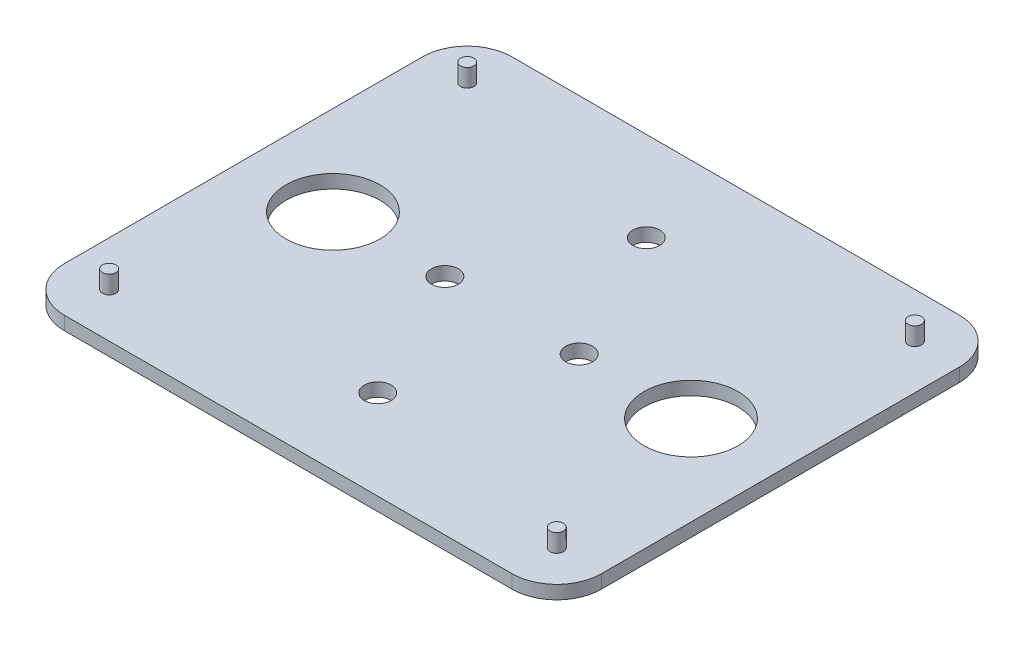
ISO-10303-21;
HEADER;
FILE_DESCRIPTION(('STEP AP214'),'2;1');
FILE_NAME('part.step','',(''),(''),'','','');
FILE_SCHEMA(('AUTOMOTIVE_DESIGN { 1 0 10303 214 1 1 1 1 }'));
ENDSEC;
DATA;
#1=APPLICATION_CONTEXT('core data for automotive mechanical design processes');
#2=APPLICATION_PROTOCOL_DEFINITION('international standard','automotive_design',2000,#1);
#3=PRODUCT_CONTEXT('',#1,'mechanical');
#4=PRODUCT('Part','Part','',(#3));
#5=PRODUCT_RELATED_PRODUCT_CATEGORY('part','',(#4));
#6=PRODUCT_DEFINITION_FORMATION('','',#4);
#7=PRODUCT_DEFINITION_CONTEXT('part definition',#1,'design');
#8=PRODUCT_DEFINITION('design','',#6,#7);
#9=PRODUCT_DEFINITION_SHAPE('','',#8);
#10=(LENGTH_UNIT() NAMED_UNIT(*) SI_UNIT(.MILLI.,.METRE.));
#11=(NAMED_UNIT(*) PLANE_ANGLE_UNIT() SI_UNIT($,.RADIAN.));
#12=(NAMED_UNIT(*) SI_UNIT($,.STERADIAN.) SOLID_ANGLE_UNIT());
#13=UNCERTAINTY_MEASURE_WITH_UNIT(LENGTH_MEASURE(1.E-05),#10,'distance_accuracy_value','');
#14=(GEOMETRIC_REPRESENTATION_CONTEXT(3) GLOBAL_UNCERTAINTY_ASSIGNED_CONTEXT((#13)) GLOBAL_UNIT_ASSIGNED_CONTEXT((#10,
#11,#12)) REPRESENTATION_CONTEXT('',''));
#15=CARTESIAN_POINT('',(0.,0.,0.));
#16=DIRECTION('',(0.,0.,1.));
#17=DIRECTION('',(1.,0.,0.));
#18=AXIS2_PLACEMENT_3D('',#15,#16,#17);
#19=CARTESIAN_POINT('',(0.,3.,0.));
#20=DIRECTION('',(-1.,0.,0.));
#21=DIRECTION('',(0.,0.,1.));
#22=AXIS2_PLACEMENT_3D('',#19,#20,#21);
#23=PLANE('',#22);
#24=DIRECTION('',(0.,0.,-1.));
#25=VECTOR('',#24,1.);
#26=CARTESIAN_POINT('',(0.,0.,0.));
#27=LINE('',#26,#25);
#28=CARTESIAN_POINT('',(0.,0.,-10.));
#29=VERTEX_POINT('',#28);
#30=CARTESIAN_POINT('',(0.,0.,-90.));
#31=VERTEX_POINT('',#30);
#32=EDGE_CURVE('E156',#29,#31,#27,.T.);
#33=ORIENTED_EDGE('',*,*,#32,.T.);
#34=DIRECTION('',(0.,-1.,0.));
#35=VECTOR('',#34,1.);
#36=CARTESIAN_POINT('',(0.,3.,-90.));
#37=LINE('',#36,#35);
#38=CARTESIAN_POINT('',(0.,3.,-90.));
#39=VERTEX_POINT('',#38);
#40=EDGE_CURVE('E11',#31,#39,#37,.F.);
#41=ORIENTED_EDGE('',*,*,#40,.T.);
#42=DIRECTION('',(0.,0.,-1.));
#43=VECTOR('',#42,1.);
#44=CARTESIAN_POINT('',(0.,3.,0.));
#45=LINE('',#44,#43);
#46=CARTESIAN_POINT('',(0.,3.,-10.));
#47=VERTEX_POINT('',#46);
#48=EDGE_CURVE('E125',#47,#39,#45,.T.);
#49=ORIENTED_EDGE('',*,*,#48,.F.);
#50=DIRECTION('',(0.,-1.,0.));
#51=VECTOR('',#50,1.);
#52=CARTESIAN_POINT('',(0.,3.,-10.));
#53=LINE('',#52,#51);
#54=EDGE_CURVE('E40',#47,#29,#53,.T.);
#55=ORIENTED_EDGE('',*,*,#54,.T.);
#56=EDGE_LOOP('',(#33,#41,#49,#55));
#57=FACE_BOUND('',#56,.T.);
#58=ADVANCED_FACE('F32',(#57),#23,.F.);
#59=CARTESIAN_POINT('',(0.,3.,-100.));
#60=DIRECTION('',(0.,0.,1.));
#61=DIRECTION('',(1.,0.,0.));
#62=AXIS2_PLACEMENT_3D('',#59,#60,#61);
#63=PLANE('',#62);
#64=DIRECTION('',(-1.,0.,0.));
#65=VECTOR('',#64,1.);
#66=CARTESIAN_POINT('',(0.,3.,-100.));
#67=LINE('',#66,#65);
#68=CARTESIAN_POINT('',(-10.,3.,-100.));
#69=VERTEX_POINT('',#68);
#70=CARTESIAN_POINT('',(-110.,3.,-100.));
#71=VERTEX_POINT('',#70);
#72=EDGE_CURVE('E128',#69,#71,#67,.T.);
#73=ORIENTED_EDGE('',*,*,#72,.F.);
#74=DIRECTION('',(0.,-1.,0.));
#75=VECTOR('',#74,1.);
#76=CARTESIAN_POINT('',(-10.,3.,-100.));
#77=LINE('',#76,#75);
#78=CARTESIAN_POINT('',(-10.,0.,-100.));
#79=VERTEX_POINT('',#78);
#80=EDGE_CURVE('E149',#69,#79,#77,.T.);
#81=ORIENTED_EDGE('',*,*,#80,.T.);
#82=DIRECTION('',(-1.,0.,0.));
#83=VECTOR('',#82,1.);
#84=CARTESIAN_POINT('',(0.,0.,-100.));
#85=LINE('',#84,#83);
#86=CARTESIAN_POINT('',(-110.,0.,-100.));
#87=VERTEX_POINT('',#86);
#88=EDGE_CURVE('E130',#79,#87,#85,.T.);
#89=ORIENTED_EDGE('',*,*,#88,.T.);
#90=DIRECTION('',(0.,-1.,0.));
#91=VECTOR('',#90,1.);
#92=CARTESIAN_POINT('',(-110.,3.,-100.));
#93=LINE('',#92,#91);
#94=EDGE_CURVE('E47',#87,#71,#93,.F.);
#95=ORIENTED_EDGE('',*,*,#94,.T.);
#96=EDGE_LOOP('',(#73,#81,#89,#95));
#97=FACE_BOUND('',#96,.T.);
#98=ADVANCED_FACE('F265',(#97),#63,.F.);
#99=CARTESIAN_POINT('',(-120.,3.,0.));
#100=DIRECTION('',(1.,0.,0.));
#101=DIRECTION('',(0.,0.,-1.));
#102=AXIS2_PLACEMENT_3D('',#99,#100,#101);
#103=PLANE('',#102);
#104=DIRECTION('',(0.,0.,1.));
#105=VECTOR('',#104,1.);
#106=CARTESIAN_POINT('',(-120.,0.,0.));
#107=LINE('',#106,#105);
#108=CARTESIAN_POINT('',(-120.,0.,-90.));
#109=VERTEX_POINT('',#108);
#110=CARTESIAN_POINT('',(-120.,0.,-9.99999999999998));
#111=VERTEX_POINT('',#110);
#112=EDGE_CURVE('E126',#109,#111,#107,.T.);
#113=ORIENTED_EDGE('',*,*,#112,.T.);
#114=DIRECTION('',(0.,-1.,0.));
#115=VECTOR('',#114,1.);
#116=CARTESIAN_POINT('',(-120.,3.,-9.99999999999999));
#117=LINE('',#116,#115);
#118=CARTESIAN_POINT('',(-120.,3.,-9.99999999999998));
#119=VERTEX_POINT('',#118);
#120=EDGE_CURVE('E103',#111,#119,#117,.F.);
#121=ORIENTED_EDGE('',*,*,#120,.T.);
#122=DIRECTION('',(0.,0.,1.));
#123=VECTOR('',#122,1.);
#124=CARTESIAN_POINT('',(-120.,3.,0.));
#125=LINE('',#124,#123);
#126=CARTESIAN_POINT('',(-120.,3.,-90.));
#127=VERTEX_POINT('',#126);
#128=EDGE_CURVE('E168',#127,#119,#125,.T.);
#129=ORIENTED_EDGE('',*,*,#128,.F.);
#130=DIRECTION('',(0.,-1.,0.));
#131=VECTOR('',#130,1.);
#132=CARTESIAN_POINT('',(-120.,3.,-90.));
#133=LINE('',#132,#131);
#134=EDGE_CURVE('E108',#127,#109,#133,.T.);
#135=ORIENTED_EDGE('',*,*,#134,.T.);
#136=EDGE_LOOP('',(#113,#121,#129,#135));
#137=FACE_BOUND('',#136,.T.);
#138=ADVANCED_FACE('F263',(#137),#103,.F.);
#139=CARTESIAN_POINT('',(0.,3.,0.));
#140=DIRECTION('',(0.,0.,-1.));
#141=DIRECTION('',(-1.,0.,0.));
#142=AXIS2_PLACEMENT_3D('',#139,#140,#141);
#143=PLANE('',#142);
#144=DIRECTION('',(1.,0.,0.));
#145=VECTOR('',#144,1.);
#146=CARTESIAN_POINT('',(0.,3.,0.));
#147=LINE('',#146,#145);
#148=CARTESIAN_POINT('',(-110.,3.,0.));
#149=VERTEX_POINT('',#148);
#150=CARTESIAN_POINT('',(-10.,3.,0.));
#151=VERTEX_POINT('',#150);
#152=EDGE_CURVE('E118',#149,#151,#147,.T.);
#153=ORIENTED_EDGE('',*,*,#152,.F.);
#154=DIRECTION('',(0.,-1.,0.));
#155=VECTOR('',#154,1.);
#156=CARTESIAN_POINT('',(-110.,3.,0.));
#157=LINE('',#156,#155);
#158=CARTESIAN_POINT('',(-110.,0.,0.));
#159=VERTEX_POINT('',#158);
#160=EDGE_CURVE('E102',#149,#159,#157,.T.);
#161=ORIENTED_EDGE('',*,*,#160,.T.);
#162=DIRECTION('',(1.,0.,0.));
#163=VECTOR('',#162,1.);
#164=CARTESIAN_POINT('',(0.,0.,0.));
#165=LINE('',#164,#163);
#166=CARTESIAN_POINT('',(-10.,0.,0.));
#167=VERTEX_POINT('',#166);
#168=EDGE_CURVE('E115',#159,#167,#165,.T.);
#169=ORIENTED_EDGE('',*,*,#168,.T.);
#170=DIRECTION('',(0.,-1.,0.));
#171=VECTOR('',#170,1.);
#172=CARTESIAN_POINT('',(-10.,3.,0.));
#173=LINE('',#172,#171);
#174=EDGE_CURVE('E120',#167,#151,#173,.F.);
#175=ORIENTED_EDGE('',*,*,#174,.T.);
#176=EDGE_LOOP('',(#153,#161,#169,#175));
#177=FACE_BOUND('',#176,.T.);
#178=ADVANCED_FACE('F114',(#177),#143,.F.);
#179=CARTESIAN_POINT('',(0.,3.,0.));
#180=DIRECTION('',(0.,1.,0.));
#181=DIRECTION('',(0.,0.,1.));
#182=AXIS2_PLACEMENT_3D('',#179,#180,#181);
#183=PLANE('',#182);
#184=CARTESIAN_POINT('',(-60.,3.,-20.));
#185=DIRECTION('',(0.,1.,0.));
#186=DIRECTION('',(0.,0.,1.));
#187=AXIS2_PLACEMENT_3D('',#184,#185,#186);
#188=CIRCLE('',#187,3.);
#189=CARTESIAN_POINT('',(-60.,3.,-17.));
#190=VERTEX_POINT('',#189);
#191=EDGE_CURVE('E223',#190,#190,#188,.T.);
#192=ORIENTED_EDGE('',*,*,#191,.F.);
#193=EDGE_LOOP('',(#192));
#194=FACE_BOUND('',#193,.T.);
#195=CARTESIAN_POINT('',(-60.,3.,-80.));
#196=DIRECTION('',(0.,1.,0.));
#197=DIRECTION('',(0.,0.,1.));
#198=AXIS2_PLACEMENT_3D('',#195,#196,#197);
#199=CIRCLE('',#198,3.);
#200=CARTESIAN_POINT('',(-60.,3.,-77.));
#201=VERTEX_POINT('',#200);
#202=EDGE_CURVE('E217',#201,#201,#199,.T.);
#203=ORIENTED_EDGE('',*,*,#202,.F.);
#204=EDGE_LOOP('',(#203));
#205=FACE_BOUND('',#204,.T.);
#206=CARTESIAN_POINT('',(-45.,3.,-50.));
#207=DIRECTION('',(0.,1.,0.));
#208=DIRECTION('',(0.,0.,1.));
#209=AXIS2_PLACEMENT_3D('',#206,#207,#208);
#210=CIRCLE('',#209,3.);
#211=CARTESIAN_POINT('',(-45.,3.,-47.));
#212=VERTEX_POINT('',#211);
#213=EDGE_CURVE('E211',#212,#212,#210,.T.);
#214=ORIENTED_EDGE('',*,*,#213,.F.);
#215=EDGE_LOOP('',(#214));
#216=FACE_BOUND('',#215,.T.);
#217=CARTESIAN_POINT('',(-75.,3.,-50.));
#218=DIRECTION('',(0.,1.,0.));
#219=DIRECTION('',(0.,0.,1.));
#220=AXIS2_PLACEMENT_3D('',#217,#218,#219);
#221=CIRCLE('',#220,3.00000000000001);
#222=CARTESIAN_POINT('',(-75.,3.,-47.));
#223=VERTEX_POINT('',#222);
#224=EDGE_CURVE('E205',#223,#223,#221,.T.);
#225=ORIENTED_EDGE('',*,*,#224,.F.);
#226=EDGE_LOOP('',(#225));
#227=FACE_BOUND('',#226,.T.);
#228=CARTESIAN_POINT('',(-20.,3.,-50.));
#229=DIRECTION('',(0.,1.,0.));
#230=DIRECTION('',(0.,0.,1.));
#231=AXIS2_PLACEMENT_3D('',#228,#229,#230);
#232=CIRCLE('',#231,10.5);
#233=CARTESIAN_POINT('',(-20.,3.,-39.5));
#234=VERTEX_POINT('',#233);
#235=EDGE_CURVE('E199',#234,#234,#232,.T.);
#236=ORIENTED_EDGE('',*,*,#235,.F.);
#237=EDGE_LOOP('',(#236));
#238=FACE_BOUND('',#237,.T.);
#239=CARTESIAN_POINT('',(-100.,3.,-50.));
#240=DIRECTION('',(0.,1.,0.));
#241=DIRECTION('',(0.,0.,1.));
#242=AXIS2_PLACEMENT_3D('',#239,#240,#241);
#243=CIRCLE('',#242,10.5);
#244=CARTESIAN_POINT('',(-100.,3.,-39.5));
#245=VERTEX_POINT('',#244);
#246=EDGE_CURVE('E193',#245,#245,#243,.T.);
#247=ORIENTED_EDGE('',*,*,#246,.F.);
#248=EDGE_LOOP('',(#247));
#249=FACE_BOUND('',#248,.T.);
#250=CARTESIAN_POINT('',(-110.,3.,-9.99999999999998));
#251=DIRECTION('',(0.,1.,0.));
#252=DIRECTION('',(0.,0.,1.));
#253=AXIS2_PLACEMENT_3D('',#250,#251,#252);
#254=CIRCLE('',#253,1.5);
#255=CARTESIAN_POINT('',(-110.,3.,-8.49999999999998));
#256=VERTEX_POINT('',#255);
#257=EDGE_CURVE('E187',#256,#256,#254,.T.);
#258=ORIENTED_EDGE('',*,*,#257,.F.);
#259=EDGE_LOOP('',(#258));
#260=FACE_BOUND('',#259,.T.);
#261=CARTESIAN_POINT('',(-10.,3.,-9.99999999999998));
#262=DIRECTION('',(0.,1.,0.));
#263=DIRECTION('',(0.,0.,1.));
#264=AXIS2_PLACEMENT_3D('',#261,#262,#263);
#265=CIRCLE('',#264,1.5);
#266=CARTESIAN_POINT('',(-10.,3.,-8.49999999999998));
#267=VERTEX_POINT('',#266);
#268=EDGE_CURVE('E181',#267,#267,#265,.T.);
#269=ORIENTED_EDGE('',*,*,#268,.F.);
#270=EDGE_LOOP('',(#269));
#271=FACE_BOUND('',#270,.T.);
#272=CARTESIAN_POINT('',(-10.,3.,-90.));
#273=DIRECTION('',(0.,1.,0.));
#274=DIRECTION('',(0.,0.,1.));
#275=AXIS2_PLACEMENT_3D('',#272,#273,#274);
#276=CIRCLE('',#275,1.5);
#277=CARTESIAN_POINT('',(-10.,3.,-88.5));
#278=VERTEX_POINT('',#277);
#279=EDGE_CURVE('E175',#278,#278,#276,.T.);
#280=ORIENTED_EDGE('',*,*,#279,.F.);
#281=EDGE_LOOP('',(#280));
#282=FACE_BOUND('',#281,.T.);
#283=CARTESIAN_POINT('',(-110.,3.,-90.));
#284=DIRECTION('',(0.,1.,0.));
#285=DIRECTION('',(0.,0.,1.));
#286=AXIS2_PLACEMENT_3D('',#283,#284,#285);
#287=CIRCLE('',#286,1.5);
#288=CARTESIAN_POINT('',(-110.,3.,-88.5));
#289=VERTEX_POINT('',#288);
#290=EDGE_CURVE('E164',#289,#289,#287,.T.);
#291=ORIENTED_EDGE('',*,*,#290,.F.);
#292=EDGE_LOOP('',(#291));
#293=FACE_BOUND('',#292,.T.);
#294=ORIENTED_EDGE('',*,*,#128,.T.);
#295=CARTESIAN_POINT('',(-110.,3.,-9.99999999999999));
#296=DIRECTION('',(0.,1.,0.));
#297=DIRECTION('',(0.,0.,1.));
#298=AXIS2_PLACEMENT_3D('',#295,#296,#297);
#299=CIRCLE('',#298,10.);
#300=EDGE_CURVE('E146',#119,#149,#299,.T.);
#301=ORIENTED_EDGE('',*,*,#300,.T.);
#302=ORIENTED_EDGE('',*,*,#152,.T.);
#303=CARTESIAN_POINT('',(-10.,3.,-10.));
#304=DIRECTION('',(0.,1.,0.));
#305=DIRECTION('',(0.,0.,1.));
#306=AXIS2_PLACEMENT_3D('',#303,#304,#305);
#307=CIRCLE('',#306,10.);
#308=EDGE_CURVE('E143',#151,#47,#307,.T.);
#309=ORIENTED_EDGE('',*,*,#308,.T.);
#310=ORIENTED_EDGE('',*,*,#48,.T.);
#311=CARTESIAN_POINT('',(-10.,3.,-90.));
#312=DIRECTION('',(0.,1.,0.));
#313=DIRECTION('',(0.,0.,1.));
#314=AXIS2_PLACEMENT_3D('',#311,#312,#313);
#315=CIRCLE('',#314,10.);
#316=EDGE_CURVE('E54',#39,#69,#315,.T.);
#317=ORIENTED_EDGE('',*,*,#316,.T.);
#318=ORIENTED_EDGE('',*,*,#72,.T.);
#319=CARTESIAN_POINT('',(-110.,3.,-90.));
#320=DIRECTION('',(0.,1.,0.));
#321=DIRECTION('',(0.,0.,1.));
#322=AXIS2_PLACEMENT_3D('',#319,#320,#321);
#323=CIRCLE('',#322,10.);
#324=EDGE_CURVE('E141',#71,#127,#323,.T.);
#325=ORIENTED_EDGE('',*,*,#324,.T.);
#326=EDGE_LOOP('',(#294,#301,#302,#309,#310,#317,#318,#325));
#327=FACE_BOUND('',#326,.T.);
#328=ADVANCED_FACE('F238',(#194,#205,#216,#227,#238,#249,#260,#271,#282,#293,#327),#183,.T.);
#329=CARTESIAN_POINT('',(0.,0.,0.));
#330=DIRECTION('',(0.,1.,0.));
#331=DIRECTION('',(0.,0.,1.));
#332=AXIS2_PLACEMENT_3D('',#329,#330,#331);
#333=PLANE('',#332);
#334=CARTESIAN_POINT('',(-60.,0.,-20.));
#335=DIRECTION('',(0.,1.,0.));
#336=DIRECTION('',(0.,0.,1.));
#337=AXIS2_PLACEMENT_3D('',#334,#335,#336);
#338=CIRCLE('',#337,3.);
#339=CARTESIAN_POINT('',(-60.,0.,-17.));
#340=VERTEX_POINT('',#339);
#341=EDGE_CURVE('E220',#340,#340,#338,.T.);
#342=ORIENTED_EDGE('',*,*,#341,.T.);
#343=EDGE_LOOP('',(#342));
#344=FACE_BOUND('',#343,.T.);
#345=CARTESIAN_POINT('',(-60.,0.,-80.));
#346=DIRECTION('',(0.,1.,0.));
#347=DIRECTION('',(0.,0.,1.));
#348=AXIS2_PLACEMENT_3D('',#345,#346,#347);
#349=CIRCLE('',#348,3.);
#350=CARTESIAN_POINT('',(-60.,0.,-77.));
#351=VERTEX_POINT('',#350);
#352=EDGE_CURVE('E214',#351,#351,#349,.T.);
#353=ORIENTED_EDGE('',*,*,#352,.T.);
#354=EDGE_LOOP('',(#353));
#355=FACE_BOUND('',#354,.T.);
#356=CARTESIAN_POINT('',(-45.,0.,-50.));
#357=DIRECTION('',(0.,1.,0.));
#358=DIRECTION('',(0.,0.,1.));
#359=AXIS2_PLACEMENT_3D('',#356,#357,#358);
#360=CIRCLE('',#359,3.);
#361=CARTESIAN_POINT('',(-45.,0.,-47.));
#362=VERTEX_POINT('',#361);
#363=EDGE_CURVE('E208',#362,#362,#360,.T.);
#364=ORIENTED_EDGE('',*,*,#363,.T.);
#365=EDGE_LOOP('',(#364));
#366=FACE_BOUND('',#365,.T.);
#367=CARTESIAN_POINT('',(-75.,0.,-50.));
#368=DIRECTION('',(0.,1.,0.));
#369=DIRECTION('',(0.,0.,1.));
#370=AXIS2_PLACEMENT_3D('',#367,#368,#369);
#371=CIRCLE('',#370,3.00000000000001);
#372=CARTESIAN_POINT('',(-75.,0.,-47.));
#373=VERTEX_POINT('',#372);
#374=EDGE_CURVE('E202',#373,#373,#371,.T.);
#375=ORIENTED_EDGE('',*,*,#374,.T.);
#376=EDGE_LOOP('',(#375));
#377=FACE_BOUND('',#376,.T.);
#378=CARTESIAN_POINT('',(-20.,0.,-50.));
#379=DIRECTION('',(0.,1.,0.));
#380=DIRECTION('',(0.,0.,1.));
#381=AXIS2_PLACEMENT_3D('',#378,#379,#380);
#382=CIRCLE('',#381,10.5);
#383=CARTESIAN_POINT('',(-20.,0.,-39.5));
#384=VERTEX_POINT('',#383);
#385=EDGE_CURVE('E196',#384,#384,#382,.T.);
#386=ORIENTED_EDGE('',*,*,#385,.T.);
#387=EDGE_LOOP('',(#386));
#388=FACE_BOUND('',#387,.T.);
#389=CARTESIAN_POINT('',(-100.,0.,-50.));
#390=DIRECTION('',(0.,1.,0.));
#391=DIRECTION('',(0.,0.,1.));
#392=AXIS2_PLACEMENT_3D('',#389,#390,#391);
#393=CIRCLE('',#392,10.5);
#394=CARTESIAN_POINT('',(-100.,0.,-39.5));
#395=VERTEX_POINT('',#394);
#396=EDGE_CURVE('E190',#395,#395,#393,.T.);
#397=ORIENTED_EDGE('',*,*,#396,.T.);
#398=EDGE_LOOP('',(#397));
#399=FACE_BOUND('',#398,.T.);
#400=ORIENTED_EDGE('',*,*,#168,.F.);
#401=CARTESIAN_POINT('',(-110.,0.,-9.99999999999999));
#402=DIRECTION('',(0.,1.,0.));
#403=DIRECTION('',(0.,0.,1.));
#404=AXIS2_PLACEMENT_3D('',#401,#402,#403);
#405=CIRCLE('',#404,10.);
#406=EDGE_CURVE('E98',#159,#111,#405,.F.);
#407=ORIENTED_EDGE('',*,*,#406,.T.);
#408=ORIENTED_EDGE('',*,*,#112,.F.);
#409=CARTESIAN_POINT('',(-110.,0.,-90.));
#410=DIRECTION('',(0.,1.,0.));
#411=DIRECTION('',(0.,0.,1.));
#412=AXIS2_PLACEMENT_3D('',#409,#410,#411);
#413=CIRCLE('',#412,10.);
#414=EDGE_CURVE('E119',#109,#87,#413,.F.);
#415=ORIENTED_EDGE('',*,*,#414,.T.);
#416=ORIENTED_EDGE('',*,*,#88,.F.);
#417=CARTESIAN_POINT('',(-10.,0.,-90.));
#418=DIRECTION('',(0.,1.,0.));
#419=DIRECTION('',(0.,0.,1.));
#420=AXIS2_PLACEMENT_3D('',#417,#418,#419);
#421=CIRCLE('',#420,10.);
#422=EDGE_CURVE('E109',#79,#31,#421,.F.);
#423=ORIENTED_EDGE('',*,*,#422,.T.);
#424=ORIENTED_EDGE('',*,*,#32,.F.);
#425=CARTESIAN_POINT('',(-10.,0.,-10.));
#426=DIRECTION('',(0.,1.,0.));
#427=DIRECTION('',(0.,0.,1.));
#428=AXIS2_PLACEMENT_3D('',#425,#426,#427);
#429=CIRCLE('',#428,10.);
#430=EDGE_CURVE('E124',#29,#167,#429,.F.);
#431=ORIENTED_EDGE('',*,*,#430,.T.);
#432=EDGE_LOOP('',(#400,#407,#408,#415,#416,#423,#424,#431));
#433=FACE_BOUND('',#432,.T.);
#434=ADVANCED_FACE('F122',(#344,#355,#366,#377,#388,#399,#433),#333,.F.);
#435=CARTESIAN_POINT('',(-110.,3.,-9.99999999999999));
#436=DIRECTION('',(0.,-1.,0.));
#437=DIRECTION('',(0.,0.,-1.));
#438=AXIS2_PLACEMENT_3D('',#435,#436,#437);
#439=CYLINDRICAL_SURFACE('',#438,10.);
#440=ORIENTED_EDGE('',*,*,#300,.F.);
#441=ORIENTED_EDGE('',*,*,#120,.F.);
#442=ORIENTED_EDGE('',*,*,#406,.F.);
#443=ORIENTED_EDGE('',*,*,#160,.F.);
#444=EDGE_LOOP('',(#440,#441,#442,#443));
#445=FACE_BOUND('',#444,.T.);
#446=ADVANCED_FACE('F101',(#445),#439,.T.);
#447=CARTESIAN_POINT('',(-10.,3.,-90.));
#448=DIRECTION('',(0.,-1.,0.));
#449=DIRECTION('',(0.,0.,-1.));
#450=AXIS2_PLACEMENT_3D('',#447,#448,#449);
#451=CYLINDRICAL_SURFACE('',#450,10.);
#452=ORIENTED_EDGE('',*,*,#316,.F.);
#453=ORIENTED_EDGE('',*,*,#40,.F.);
#454=ORIENTED_EDGE('',*,*,#422,.F.);
#455=ORIENTED_EDGE('',*,*,#80,.F.);
#456=EDGE_LOOP('',(#452,#453,#454,#455));
#457=FACE_BOUND('',#456,.T.);
#458=ADVANCED_FACE('F268',(#457),#451,.T.);
#459=CARTESIAN_POINT('',(-10.,3.,-10.));
#460=DIRECTION('',(0.,-1.,0.));
#461=DIRECTION('',(0.,0.,-1.));
#462=AXIS2_PLACEMENT_3D('',#459,#460,#461);
#463=CYLINDRICAL_SURFACE('',#462,10.);
#464=ORIENTED_EDGE('',*,*,#308,.F.);
#465=ORIENTED_EDGE('',*,*,#174,.F.);
#466=ORIENTED_EDGE('',*,*,#430,.F.);
#467=ORIENTED_EDGE('',*,*,#54,.F.);
#468=EDGE_LOOP('',(#464,#465,#466,#467));
#469=FACE_BOUND('',#468,.T.);
#470=ADVANCED_FACE('F269',(#469),#463,.T.);
#471=CARTESIAN_POINT('',(-110.,3.,-90.));
#472=DIRECTION('',(0.,-1.,0.));
#473=DIRECTION('',(0.,0.,-1.));
#474=AXIS2_PLACEMENT_3D('',#471,#472,#473);
#475=CYLINDRICAL_SURFACE('',#474,10.);
#476=ORIENTED_EDGE('',*,*,#324,.F.);
#477=ORIENTED_EDGE('',*,*,#94,.F.);
#478=ORIENTED_EDGE('',*,*,#414,.F.);
#479=ORIENTED_EDGE('',*,*,#134,.F.);
#480=EDGE_LOOP('',(#476,#477,#478,#479));
#481=FACE_BOUND('',#480,.T.);
#482=ADVANCED_FACE('F34',(#481),#475,.T.);
#483=CARTESIAN_POINT('',(-110.,7.,-90.));
#484=DIRECTION('',(0.,-1.,0.));
#485=DIRECTION('',(0.,0.,-1.));
#486=AXIS2_PLACEMENT_3D('',#483,#484,#485);
#487=CYLINDRICAL_SURFACE('',#486,1.5);
#488=CARTESIAN_POINT('',(-110.,7.,-90.));
#489=DIRECTION('',(0.,1.,0.));
#490=DIRECTION('',(0.,0.,1.));
#491=AXIS2_PLACEMENT_3D('',#488,#489,#490);
#492=CIRCLE('',#491,1.5);
#493=CARTESIAN_POINT('',(-110.,7.,-88.5));
#494=VERTEX_POINT('',#493);
#495=EDGE_CURVE('E161',#494,#494,#492,.T.);
#496=ORIENTED_EDGE('',*,*,#495,.F.);
#497=EDGE_LOOP('',(#496));
#498=FACE_BOUND('',#497,.T.);
#499=ORIENTED_EDGE('',*,*,#290,.T.);
#500=EDGE_LOOP('',(#499));
#501=FACE_BOUND('',#500,.T.);
#502=ADVANCED_FACE('F275',(#498,#501),#487,.T.);
#503=CARTESIAN_POINT('',(-110.,7.,-90.));
#504=DIRECTION('',(0.,1.,0.));
#505=DIRECTION('',(0.,0.,1.));
#506=AXIS2_PLACEMENT_3D('',#503,#504,#505);
#507=PLANE('',#506);
#508=ORIENTED_EDGE('',*,*,#495,.T.);
#509=EDGE_LOOP('',(#508));
#510=FACE_BOUND('',#509,.T.);
#511=ADVANCED_FACE('F402',(#510),#507,.T.);
#512=CARTESIAN_POINT('',(-10.,7.,-90.));
#513=DIRECTION('',(0.,-1.,0.));
#514=DIRECTION('',(0.,0.,-1.));
#515=AXIS2_PLACEMENT_3D('',#512,#513,#514);
#516=CYLINDRICAL_SURFACE('',#515,1.5);
#517=CARTESIAN_POINT('',(-10.,7.,-90.));
#518=DIRECTION('',(0.,1.,0.));
#519=DIRECTION('',(0.,0.,1.));
#520=AXIS2_PLACEMENT_3D('',#517,#518,#519);
#521=CIRCLE('',#520,1.5);
#522=CARTESIAN_POINT('',(-10.,7.,-88.5));
#523=VERTEX_POINT('',#522);
#524=EDGE_CURVE('E173',#523,#523,#521,.T.);
#525=ORIENTED_EDGE('',*,*,#524,.F.);
#526=EDGE_LOOP('',(#525));
#527=FACE_BOUND('',#526,.T.);
#528=ORIENTED_EDGE('',*,*,#279,.T.);
#529=EDGE_LOOP('',(#528));
#530=FACE_BOUND('',#529,.T.);
#531=ADVANCED_FACE('F398',(#527,#530),#516,.T.);
#532=CARTESIAN_POINT('',(-10.,7.,-90.));
#533=DIRECTION('',(0.,1.,0.));
#534=DIRECTION('',(0.,0.,1.));
#535=AXIS2_PLACEMENT_3D('',#532,#533,#534);
#536=PLANE('',#535);
#537=ORIENTED_EDGE('',*,*,#524,.T.);
#538=EDGE_LOOP('',(#537));
#539=FACE_BOUND('',#538,.T.);
#540=ADVANCED_FACE('F394',(#539),#536,.T.);
#541=CARTESIAN_POINT('',(-10.,7.,-9.99999999999998));
#542=DIRECTION('',(0.,-1.,0.));
#543=DIRECTION('',(0.,0.,-1.));
#544=AXIS2_PLACEMENT_3D('',#541,#542,#543);
#545=CYLINDRICAL_SURFACE('',#544,1.5);
#546=CARTESIAN_POINT('',(-10.,7.,-9.99999999999998));
#547=DIRECTION('',(0.,1.,0.));
#548=DIRECTION('',(0.,0.,1.));
#549=AXIS2_PLACEMENT_3D('',#546,#547,#548);
#550=CIRCLE('',#549,1.5);
#551=CARTESIAN_POINT('',(-10.,7.,-8.49999999999998));
#552=VERTEX_POINT('',#551);
#553=EDGE_CURVE('E178',#552,#552,#550,.T.);
#554=ORIENTED_EDGE('',*,*,#553,.F.);
#555=EDGE_LOOP('',(#554));
#556=FACE_BOUND('',#555,.T.);
#557=ORIENTED_EDGE('',*,*,#268,.T.);
#558=EDGE_LOOP('',(#557));
#559=FACE_BOUND('',#558,.T.);
#560=ADVANCED_FACE('F390',(#556,#559),#545,.T.);
#561=CARTESIAN_POINT('',(-10.,7.,-9.99999999999998));
#562=DIRECTION('',(0.,1.,0.));
#563=DIRECTION('',(0.,0.,1.));
#564=AXIS2_PLACEMENT_3D('',#561,#562,#563);
#565=PLANE('',#564);
#566=ORIENTED_EDGE('',*,*,#553,.T.);
#567=EDGE_LOOP('',(#566));
#568=FACE_BOUND('',#567,.T.);
#569=ADVANCED_FACE('F386',(#568),#565,.T.);
#570=CARTESIAN_POINT('',(-110.,7.,-9.99999999999998));
#571=DIRECTION('',(0.,-1.,0.));
#572=DIRECTION('',(0.,0.,-1.));
#573=AXIS2_PLACEMENT_3D('',#570,#571,#572);
#574=CYLINDRICAL_SURFACE('',#573,1.5);
#575=CARTESIAN_POINT('',(-110.,7.,-9.99999999999998));
#576=DIRECTION('',(0.,1.,0.));
#577=DIRECTION('',(0.,0.,1.));
#578=AXIS2_PLACEMENT_3D('',#575,#576,#577);
#579=CIRCLE('',#578,1.5);
#580=CARTESIAN_POINT('',(-110.,7.,-8.49999999999998));
#581=VERTEX_POINT('',#580);
#582=EDGE_CURVE('E184',#581,#581,#579,.T.);
#583=ORIENTED_EDGE('',*,*,#582,.F.);
#584=EDGE_LOOP('',(#583));
#585=FACE_BOUND('',#584,.T.);
#586=ORIENTED_EDGE('',*,*,#257,.T.);
#587=EDGE_LOOP('',(#586));
#588=FACE_BOUND('',#587,.T.);
#589=ADVANCED_FACE('F382',(#585,#588),#574,.T.);
#590=CARTESIAN_POINT('',(-110.,7.,-9.99999999999998));
#591=DIRECTION('',(0.,1.,0.));
#592=DIRECTION('',(0.,0.,1.));
#593=AXIS2_PLACEMENT_3D('',#590,#591,#592);
#594=PLANE('',#593);
#595=ORIENTED_EDGE('',*,*,#582,.T.);
#596=EDGE_LOOP('',(#595));
#597=FACE_BOUND('',#596,.T.);
#598=ADVANCED_FACE('F314',(#597),#594,.T.);
#599=CARTESIAN_POINT('',(-100.,0.,-50.));
#600=DIRECTION('',(0.,1.,0.));
#601=DIRECTION('',(0.,0.,1.));
#602=AXIS2_PLACEMENT_3D('',#599,#600,#601);
#603=CYLINDRICAL_SURFACE('',#602,10.5);
#604=ORIENTED_EDGE('',*,*,#396,.F.);
#605=EDGE_LOOP('',(#604));
#606=FACE_BOUND('',#605,.T.);
#607=ORIENTED_EDGE('',*,*,#246,.T.);
#608=EDGE_LOOP('',(#607));
#609=FACE_BOUND('',#608,.T.);
#610=ADVANCED_FACE('F324',(#606,#609),#603,.F.);
#611=CARTESIAN_POINT('',(-20.,0.,-50.));
#612=DIRECTION('',(0.,1.,0.));
#613=DIRECTION('',(0.,0.,1.));
#614=AXIS2_PLACEMENT_3D('',#611,#612,#613);
#615=CYLINDRICAL_SURFACE('',#614,10.5);
#616=ORIENTED_EDGE('',*,*,#385,.F.);
#617=EDGE_LOOP('',(#616));
#618=FACE_BOUND('',#617,.T.);
#619=ORIENTED_EDGE('',*,*,#235,.T.);
#620=EDGE_LOOP('',(#619));
#621=FACE_BOUND('',#620,.T.);
#622=ADVANCED_FACE('F329',(#618,#621),#615,.F.);
#623=CARTESIAN_POINT('',(-75.,0.,-50.));
#624=DIRECTION('',(0.,1.,0.));
#625=DIRECTION('',(0.,0.,1.));
#626=AXIS2_PLACEMENT_3D('',#623,#624,#625);
#627=CYLINDRICAL_SURFACE('',#626,3.00000000000001);
#628=ORIENTED_EDGE('',*,*,#374,.F.);
#629=EDGE_LOOP('',(#628));
#630=FACE_BOUND('',#629,.T.);
#631=ORIENTED_EDGE('',*,*,#224,.T.);
#632=EDGE_LOOP('',(#631));
#633=FACE_BOUND('',#632,.T.);
#634=ADVANCED_FACE('F339',(#630,#633),#627,.F.);
#635=CARTESIAN_POINT('',(-45.,0.,-50.));
#636=DIRECTION('',(0.,1.,0.));
#637=DIRECTION('',(0.,0.,1.));
#638=AXIS2_PLACEMENT_3D('',#635,#636,#637);
#639=CYLINDRICAL_SURFACE('',#638,3.);
#640=ORIENTED_EDGE('',*,*,#363,.F.);
#641=EDGE_LOOP('',(#640));
#642=FACE_BOUND('',#641,.T.);
#643=ORIENTED_EDGE('',*,*,#213,.T.);
#644=EDGE_LOOP('',(#643));
#645=FACE_BOUND('',#644,.T.);
#646=ADVANCED_FACE('F349',(#642,#645),#639,.F.);
#647=CARTESIAN_POINT('',(-60.,0.,-80.));
#648=DIRECTION('',(0.,1.,0.));
#649=DIRECTION('',(0.,0.,1.));
#650=AXIS2_PLACEMENT_3D('',#647,#648,#649);
#651=CYLINDRICAL_SURFACE('',#650,3.);
#652=ORIENTED_EDGE('',*,*,#352,.F.);
#653=EDGE_LOOP('',(#652));
#654=FACE_BOUND('',#653,.T.);
#655=ORIENTED_EDGE('',*,*,#202,.T.);
#656=EDGE_LOOP('',(#655));
#657=FACE_BOUND('',#656,.T.);
#658=ADVANCED_FACE('F234',(#654,#657),#651,.F.);
#659=CARTESIAN_POINT('',(-60.,0.,-20.));
#660=DIRECTION('',(0.,1.,0.));
#661=DIRECTION('',(0.,0.,1.));
#662=AXIS2_PLACEMENT_3D('',#659,#660,#661);
#663=CYLINDRICAL_SURFACE('',#662,3.);
#664=ORIENTED_EDGE('',*,*,#341,.F.);
#665=EDGE_LOOP('',(#664));
#666=FACE_BOUND('',#665,.T.);
#667=ORIENTED_EDGE('',*,*,#191,.T.);
#668=EDGE_LOOP('',(#667));
#669=FACE_BOUND('',#668,.T.);
#670=ADVANCED_FACE('F231',(#666,#669),#663,.F.);
#671=CLOSED_SHELL('',(#58,#98,#138,#178,#328,#434,#446,#458,#470,#482,#502,#511,#531,#540,#560,
#569,#589,#598,#610,#622,#634,#646,#658,#670));
#672=MANIFOLD_SOLID_BREP('B2',#671);
#673=ADVANCED_BREP_SHAPE_REPRESENTATION('',(#18,#672),#14);
#674=SHAPE_DEFINITION_REPRESENTATION(#9,#673);
ENDSEC;
END-ISO-10303-21;
